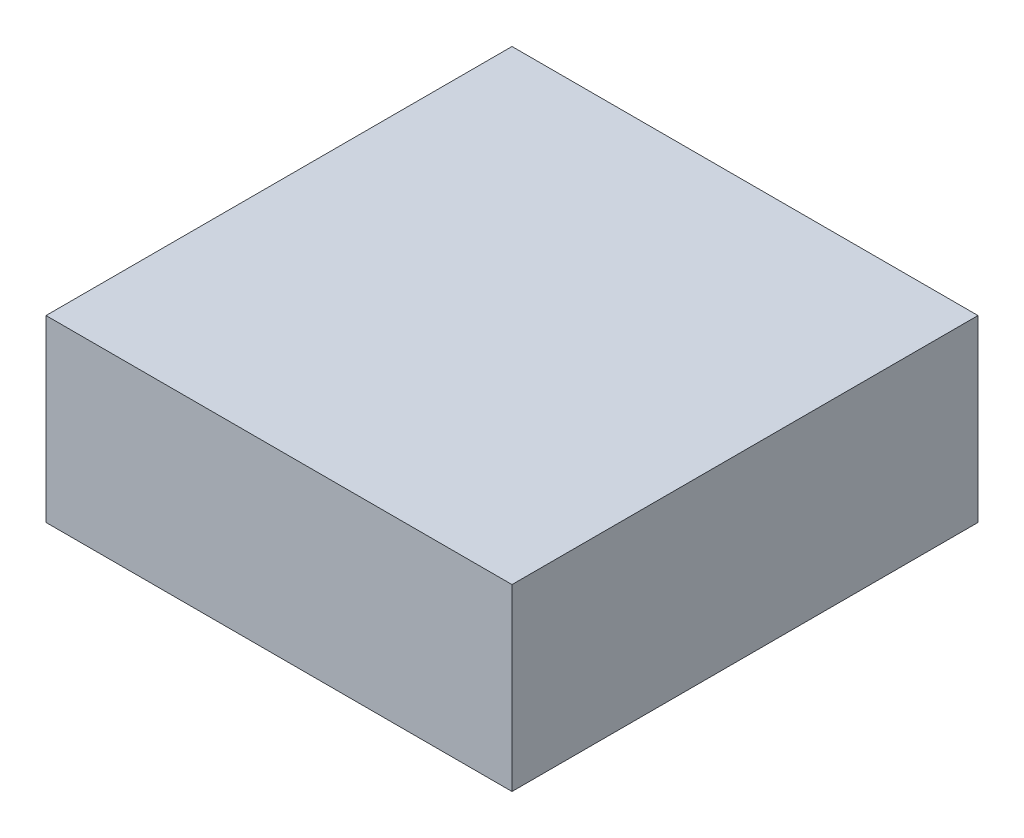
ISO-10303-21;
HEADER;
FILE_DESCRIPTION(('STEP AP214'),'2;1');
FILE_NAME('part.step','',(''),(''),'','','');
FILE_SCHEMA(('AUTOMOTIVE_DESIGN { 1 0 10303 214 1 1 1 1 }'));
ENDSEC;
DATA;
#1=APPLICATION_CONTEXT('core data for automotive mechanical design processes');
#2=APPLICATION_PROTOCOL_DEFINITION('international standard','automotive_design',2000,#1);
#3=PRODUCT_CONTEXT('',#1,'mechanical');
#4=PRODUCT('Part','Part','',(#3));
#5=PRODUCT_RELATED_PRODUCT_CATEGORY('part','',(#4));
#6=PRODUCT_DEFINITION_FORMATION('','',#4);
#7=PRODUCT_DEFINITION_CONTEXT('part definition',#1,'design');
#8=PRODUCT_DEFINITION('design','',#6,#7);
#9=PRODUCT_DEFINITION_SHAPE('','',#8);
#10=(LENGTH_UNIT() NAMED_UNIT(*) SI_UNIT(.MILLI.,.METRE.));
#11=(NAMED_UNIT(*) PLANE_ANGLE_UNIT() SI_UNIT($,.RADIAN.));
#12=(NAMED_UNIT(*) SI_UNIT($,.STERADIAN.) SOLID_ANGLE_UNIT());
#13=UNCERTAINTY_MEASURE_WITH_UNIT(LENGTH_MEASURE(1.E-05),#10,'distance_accuracy_value','');
#14=(GEOMETRIC_REPRESENTATION_CONTEXT(3) GLOBAL_UNCERTAINTY_ASSIGNED_CONTEXT((#13)) GLOBAL_UNIT_ASSIGNED_CONTEXT((#10,
#11,#12)) REPRESENTATION_CONTEXT('',''));
#15=CARTESIAN_POINT('',(0.,0.,0.));
#16=DIRECTION('',(0.,0.,1.));
#17=DIRECTION('',(1.,0.,0.));
#18=AXIS2_PLACEMENT_3D('',#15,#16,#17);
#19=CARTESIAN_POINT('',(0.,50.,0.));
#20=DIRECTION('',(1.,0.,0.));
#21=DIRECTION('',(0.,0.,-1.));
#22=AXIS2_PLACEMENT_3D('',#19,#20,#21);
#23=PLANE('',#22);
#24=DIRECTION('',(0.,0.,1.));
#25=VECTOR('',#24,1.);
#26=CARTESIAN_POINT('',(0.,0.,0.));
#27=LINE('',#26,#25);
#28=CARTESIAN_POINT('',(0.,0.,-130.));
#29=VERTEX_POINT('',#28);
#30=CARTESIAN_POINT('',(0.,0.,0.));
#31=VERTEX_POINT('',#30);
#32=EDGE_CURVE('E166',#29,#31,#27,.T.);
#33=ORIENTED_EDGE('',*,*,#32,.T.);
#34=DIRECTION('',(0.,-1.,0.));
#35=VECTOR('',#34,1.);
#36=CARTESIAN_POINT('',(0.,50.,0.));
#37=LINE('',#36,#35);
#38=CARTESIAN_POINT('',(0.,50.,0.));
#39=VERTEX_POINT('',#38);
#40=EDGE_CURVE('E11',#39,#31,#37,.T.);
#41=ORIENTED_EDGE('',*,*,#40,.F.);
#42=DIRECTION('',(0.,0.,1.));
#43=VECTOR('',#42,1.);
#44=CARTESIAN_POINT('',(0.,50.,0.));
#45=LINE('',#44,#43);
#46=CARTESIAN_POINT('',(0.,50.,-130.));
#47=VERTEX_POINT('',#46);
#48=EDGE_CURVE('E172',#47,#39,#45,.T.);
#49=ORIENTED_EDGE('',*,*,#48,.F.);
#50=DIRECTION('',(0.,-1.,0.));
#51=VECTOR('',#50,1.);
#52=CARTESIAN_POINT('',(0.,50.,-130.));
#53=LINE('',#52,#51);
#54=EDGE_CURVE('E182',#47,#29,#53,.T.);
#55=ORIENTED_EDGE('',*,*,#54,.T.);
#56=EDGE_LOOP('',(#33,#41,#49,#55));
#57=FACE_BOUND('',#56,.T.);
#58=ADVANCED_FACE('F43',(#57),#23,.F.);
#59=CARTESIAN_POINT('',(0.,50.,0.));
#60=DIRECTION('',(0.,0.,-1.));
#61=DIRECTION('',(-1.,0.,0.));
#62=AXIS2_PLACEMENT_3D('',#59,#60,#61);
#63=PLANE('',#62);
#64=DIRECTION('',(1.,0.,0.));
#65=VECTOR('',#64,1.);
#66=CARTESIAN_POINT('',(0.,0.,0.));
#67=LINE('',#66,#65);
#68=CARTESIAN_POINT('',(130.,0.,0.));
#69=VERTEX_POINT('',#68);
#70=EDGE_CURVE('E186',#31,#69,#67,.T.);
#71=ORIENTED_EDGE('',*,*,#70,.T.);
#72=DIRECTION('',(0.,-1.,0.));
#73=VECTOR('',#72,1.);
#74=CARTESIAN_POINT('',(130.,50.,0.));
#75=LINE('',#74,#73);
#76=CARTESIAN_POINT('',(130.,50.,0.));
#77=VERTEX_POINT('',#76);
#78=EDGE_CURVE('E51',#77,#69,#75,.T.);
#79=ORIENTED_EDGE('',*,*,#78,.F.);
#80=DIRECTION('',(1.,0.,0.));
#81=VECTOR('',#80,1.);
#82=CARTESIAN_POINT('',(0.,50.,0.));
#83=LINE('',#82,#81);
#84=EDGE_CURVE('E95',#39,#77,#83,.T.);
#85=ORIENTED_EDGE('',*,*,#84,.F.);
#86=ORIENTED_EDGE('',*,*,#40,.T.);
#87=EDGE_LOOP('',(#71,#79,#85,#86));
#88=FACE_BOUND('',#87,.T.);
#89=ADVANCED_FACE('F220',(#88),#63,.F.);
#90=CARTESIAN_POINT('',(130.,50.,0.));
#91=DIRECTION('',(-1.,0.,0.));
#92=DIRECTION('',(0.,0.,1.));
#93=AXIS2_PLACEMENT_3D('',#90,#91,#92);
#94=PLANE('',#93);
#95=DIRECTION('',(0.,0.,-1.));
#96=VECTOR('',#95,1.);
#97=CARTESIAN_POINT('',(130.,0.,0.));
#98=LINE('',#97,#96);
#99=CARTESIAN_POINT('',(130.,0.,-130.));
#100=VERTEX_POINT('',#99);
#101=EDGE_CURVE('E189',#69,#100,#98,.T.);
#102=ORIENTED_EDGE('',*,*,#101,.T.);
#103=DIRECTION('',(0.,-1.,0.));
#104=VECTOR('',#103,1.);
#105=CARTESIAN_POINT('',(130.,50.,-130.));
#106=LINE('',#105,#104);
#107=CARTESIAN_POINT('',(130.,50.,-130.));
#108=VERTEX_POINT('',#107);
#109=EDGE_CURVE('E196',#108,#100,#106,.T.);
#110=ORIENTED_EDGE('',*,*,#109,.F.);
#111=DIRECTION('',(0.,0.,-1.));
#112=VECTOR('',#111,1.);
#113=CARTESIAN_POINT('',(130.,50.,0.));
#114=LINE('',#113,#112);
#115=EDGE_CURVE('E177',#77,#108,#114,.T.);
#116=ORIENTED_EDGE('',*,*,#115,.F.);
#117=ORIENTED_EDGE('',*,*,#78,.T.);
#118=EDGE_LOOP('',(#102,#110,#116,#117));
#119=FACE_BOUND('',#118,.T.);
#120=ADVANCED_FACE('F203',(#119),#94,.F.);
#121=CARTESIAN_POINT('',(0.,50.,-130.));
#122=DIRECTION('',(0.,0.,1.));
#123=DIRECTION('',(1.,0.,0.));
#124=AXIS2_PLACEMENT_3D('',#121,#122,#123);
#125=PLANE('',#124);
#126=DIRECTION('',(-1.,0.,0.));
#127=VECTOR('',#126,1.);
#128=CARTESIAN_POINT('',(0.,0.,-130.));
#129=LINE('',#128,#127);
#130=EDGE_CURVE('E88',#100,#29,#129,.T.);
#131=ORIENTED_EDGE('',*,*,#130,.T.);
#132=ORIENTED_EDGE('',*,*,#54,.F.);
#133=DIRECTION('',(-1.,0.,0.));
#134=VECTOR('',#133,1.);
#135=CARTESIAN_POINT('',(0.,50.,-130.));
#136=LINE('',#135,#134);
#137=EDGE_CURVE('E67',#108,#47,#136,.T.);
#138=ORIENTED_EDGE('',*,*,#137,.F.);
#139=ORIENTED_EDGE('',*,*,#109,.T.);
#140=EDGE_LOOP('',(#131,#132,#138,#139));
#141=FACE_BOUND('',#140,.T.);
#142=ADVANCED_FACE('F211',(#141),#125,.F.);
#143=CARTESIAN_POINT('',(0.,50.,0.));
#144=DIRECTION('',(0.,-1.,0.));
#145=DIRECTION('',(0.,0.,-1.));
#146=AXIS2_PLACEMENT_3D('',#143,#144,#145);
#147=PLANE('',#146);
#148=ORIENTED_EDGE('',*,*,#48,.T.);
#149=ORIENTED_EDGE('',*,*,#84,.T.);
#150=ORIENTED_EDGE('',*,*,#115,.T.);
#151=ORIENTED_EDGE('',*,*,#137,.T.);
#152=EDGE_LOOP('',(#148,#149,#150,#151));
#153=FACE_BOUND('',#152,.T.);
#154=ADVANCED_FACE('F213',(#153),#147,.F.);
#155=CARTESIAN_POINT('',(0.,0.,0.));
#156=DIRECTION('',(0.,-1.,0.));
#157=DIRECTION('',(0.,0.,-1.));
#158=AXIS2_PLACEMENT_3D('',#155,#156,#157);
#159=PLANE('',#158);
#160=DIRECTION('',(0.,0.,-1.));
#161=VECTOR('',#160,1.);
#162=CARTESIAN_POINT('',(5.,0.,-5.));
#163=LINE('',#162,#161);
#164=CARTESIAN_POINT('',(5.,0.,-5.));
#165=VERTEX_POINT('',#164);
#166=CARTESIAN_POINT('',(5.00000000000002,0.,-125.));
#167=VERTEX_POINT('',#166);
#168=EDGE_CURVE('E58',#165,#167,#163,.T.);
#169=ORIENTED_EDGE('',*,*,#168,.F.);
#170=DIRECTION('',(-1.,0.,0.));
#171=VECTOR('',#170,1.);
#172=CARTESIAN_POINT('',(5.,0.,-5.));
#173=LINE('',#172,#171);
#174=CARTESIAN_POINT('',(125.,0.,-5.));
#175=VERTEX_POINT('',#174);
#176=EDGE_CURVE('E140',#175,#165,#173,.T.);
#177=ORIENTED_EDGE('',*,*,#176,.F.);
#178=DIRECTION('',(0.,0.,1.));
#179=VECTOR('',#178,1.);
#180=CARTESIAN_POINT('',(125.,0.,-5.));
#181=LINE('',#180,#179);
#182=CARTESIAN_POINT('',(125.,0.,-125.));
#183=VERTEX_POINT('',#182);
#184=EDGE_CURVE('E144',#183,#175,#181,.T.);
#185=ORIENTED_EDGE('',*,*,#184,.F.);
#186=DIRECTION('',(1.,0.,0.));
#187=VECTOR('',#186,1.);
#188=CARTESIAN_POINT('',(5.00000000000002,0.,-125.));
#189=LINE('',#188,#187);
#190=EDGE_CURVE('E156',#167,#183,#189,.T.);
#191=ORIENTED_EDGE('',*,*,#190,.F.);
#192=EDGE_LOOP('',(#169,#177,#185,#191));
#193=FACE_BOUND('',#192,.T.);
#194=ORIENTED_EDGE('',*,*,#32,.F.);
#195=ORIENTED_EDGE('',*,*,#130,.F.);
#196=ORIENTED_EDGE('',*,*,#101,.F.);
#197=ORIENTED_EDGE('',*,*,#70,.F.);
#198=EDGE_LOOP('',(#194,#195,#196,#197));
#199=FACE_BOUND('',#198,.T.);
#200=ADVANCED_FACE('F207',(#193,#199),#159,.T.);
#201=CARTESIAN_POINT('',(5.,45.,-5.));
#202=DIRECTION('',(-1.,0.,0.));
#203=DIRECTION('',(0.,0.,1.));
#204=AXIS2_PLACEMENT_3D('',#201,#202,#203);
#205=PLANE('',#204);
#206=ORIENTED_EDGE('',*,*,#168,.T.);
#207=DIRECTION('',(0.,-1.,0.));
#208=VECTOR('',#207,1.);
#209=CARTESIAN_POINT('',(5.00000000000002,45.,-125.));
#210=LINE('',#209,#208);
#211=CARTESIAN_POINT('',(5.00000000000002,45.,-125.));
#212=VERTEX_POINT('',#211);
#213=EDGE_CURVE('E115',#212,#167,#210,.T.);
#214=ORIENTED_EDGE('',*,*,#213,.F.);
#215=DIRECTION('',(0.,0.,-1.));
#216=VECTOR('',#215,1.);
#217=CARTESIAN_POINT('',(5.,45.,-5.));
#218=LINE('',#217,#216);
#219=CARTESIAN_POINT('',(5.,45.,-5.));
#220=VERTEX_POINT('',#219);
#221=EDGE_CURVE('E119',#220,#212,#218,.T.);
#222=ORIENTED_EDGE('',*,*,#221,.F.);
#223=DIRECTION('',(0.,-1.,0.));
#224=VECTOR('',#223,1.);
#225=CARTESIAN_POINT('',(5.,45.,-5.));
#226=LINE('',#225,#224);
#227=EDGE_CURVE('E163',#220,#165,#226,.T.);
#228=ORIENTED_EDGE('',*,*,#227,.T.);
#229=EDGE_LOOP('',(#206,#214,#222,#228));
#230=FACE_BOUND('',#229,.T.);
#231=ADVANCED_FACE('F117',(#230),#205,.F.);
#232=CARTESIAN_POINT('',(5.,45.,-5.));
#233=DIRECTION('',(0.,0.,1.));
#234=DIRECTION('',(1.,0.,0.));
#235=AXIS2_PLACEMENT_3D('',#232,#233,#234);
#236=PLANE('',#235);
#237=ORIENTED_EDGE('',*,*,#176,.T.);
#238=ORIENTED_EDGE('',*,*,#227,.F.);
#239=DIRECTION('',(-1.,0.,0.));
#240=VECTOR('',#239,1.);
#241=CARTESIAN_POINT('',(5.,45.,-5.));
#242=LINE('',#241,#240);
#243=CARTESIAN_POINT('',(125.,45.,-5.));
#244=VERTEX_POINT('',#243);
#245=EDGE_CURVE('E126',#244,#220,#242,.T.);
#246=ORIENTED_EDGE('',*,*,#245,.F.);
#247=DIRECTION('',(0.,-1.,0.));
#248=VECTOR('',#247,1.);
#249=CARTESIAN_POINT('',(125.,45.,-5.));
#250=LINE('',#249,#248);
#251=EDGE_CURVE('E167',#244,#175,#250,.T.);
#252=ORIENTED_EDGE('',*,*,#251,.T.);
#253=EDGE_LOOP('',(#237,#238,#246,#252));
#254=FACE_BOUND('',#253,.T.);
#255=ADVANCED_FACE('F264',(#254),#236,.F.);
#256=CARTESIAN_POINT('',(125.,45.,-5.));
#257=DIRECTION('',(1.,0.,0.));
#258=DIRECTION('',(0.,0.,-1.));
#259=AXIS2_PLACEMENT_3D('',#256,#257,#258);
#260=PLANE('',#259);
#261=ORIENTED_EDGE('',*,*,#184,.T.);
#262=ORIENTED_EDGE('',*,*,#251,.F.);
#263=DIRECTION('',(0.,0.,1.));
#264=VECTOR('',#263,1.);
#265=CARTESIAN_POINT('',(125.,45.,-5.));
#266=LINE('',#265,#264);
#267=CARTESIAN_POINT('',(125.,45.,-125.));
#268=VERTEX_POINT('',#267);
#269=EDGE_CURVE('E135',#268,#244,#266,.T.);
#270=ORIENTED_EDGE('',*,*,#269,.F.);
#271=DIRECTION('',(0.,-1.,0.));
#272=VECTOR('',#271,1.);
#273=CARTESIAN_POINT('',(125.,45.,-125.));
#274=LINE('',#273,#272);
#275=EDGE_CURVE('E125',#268,#183,#274,.T.);
#276=ORIENTED_EDGE('',*,*,#275,.T.);
#277=EDGE_LOOP('',(#261,#262,#270,#276));
#278=FACE_BOUND('',#277,.T.);
#279=ADVANCED_FACE('F274',(#278),#260,.F.);
#280=CARTESIAN_POINT('',(5.00000000000002,45.,-125.));
#281=DIRECTION('',(0.,0.,-1.));
#282=DIRECTION('',(-1.,0.,0.));
#283=AXIS2_PLACEMENT_3D('',#280,#281,#282);
#284=PLANE('',#283);
#285=ORIENTED_EDGE('',*,*,#190,.T.);
#286=ORIENTED_EDGE('',*,*,#275,.F.);
#287=DIRECTION('',(1.,0.,0.));
#288=VECTOR('',#287,1.);
#289=CARTESIAN_POINT('',(5.00000000000002,45.,-125.));
#290=LINE('',#289,#288);
#291=EDGE_CURVE('E129',#212,#268,#290,.T.);
#292=ORIENTED_EDGE('',*,*,#291,.F.);
#293=ORIENTED_EDGE('',*,*,#213,.T.);
#294=EDGE_LOOP('',(#285,#286,#292,#293));
#295=FACE_BOUND('',#294,.T.);
#296=ADVANCED_FACE('F130',(#295),#284,.F.);
#297=CARTESIAN_POINT('',(0.,45.,0.));
#298=DIRECTION('',(0.,-1.,0.));
#299=DIRECTION('',(0.,0.,-1.));
#300=AXIS2_PLACEMENT_3D('',#297,#298,#299);
#301=PLANE('',#300);
#302=CARTESIAN_POINT('',(121.,45.,-9.));
#303=DIRECTION('',(0.,-1.,0.));
#304=DIRECTION('',(0.,0.,-1.));
#305=AXIS2_PLACEMENT_3D('',#302,#303,#304);
#306=CIRCLE('',#305,2.5);
#307=CARTESIAN_POINT('',(121.,45.,-11.5));
#308=VERTEX_POINT('',#307);
#309=EDGE_CURVE('E428',#308,#308,#306,.T.);
#310=ORIENTED_EDGE('',*,*,#309,.F.);
#311=EDGE_LOOP('',(#310));
#312=FACE_BOUND('',#311,.T.);
#313=CARTESIAN_POINT('',(9.00000000000001,45.,-9.00000000000001));
#314=DIRECTION('',(0.,-1.,0.));
#315=DIRECTION('',(0.,0.,-1.));
#316=AXIS2_PLACEMENT_3D('',#313,#314,#315);
#317=CIRCLE('',#316,2.49999999999999);
#318=CARTESIAN_POINT('',(9.00000000000001,45.,-11.5));
#319=VERTEX_POINT('',#318);
#320=EDGE_CURVE('E435',#319,#319,#317,.T.);
#321=ORIENTED_EDGE('',*,*,#320,.F.);
#322=EDGE_LOOP('',(#321));
#323=FACE_BOUND('',#322,.T.);
#324=CARTESIAN_POINT('',(121.,45.,-121.));
#325=DIRECTION('',(0.,-1.,0.));
#326=DIRECTION('',(0.,0.,-1.));
#327=AXIS2_PLACEMENT_3D('',#324,#325,#326);
#328=CIRCLE('',#327,2.5);
#329=CARTESIAN_POINT('',(121.,45.,-123.5));
#330=VERTEX_POINT('',#329);
#331=EDGE_CURVE('E443',#330,#330,#328,.T.);
#332=ORIENTED_EDGE('',*,*,#331,.F.);
#333=EDGE_LOOP('',(#332));
#334=FACE_BOUND('',#333,.T.);
#335=CARTESIAN_POINT('',(9.00000000000002,45.,-121.));
#336=DIRECTION('',(0.,-1.,0.));
#337=DIRECTION('',(0.,0.,-1.));
#338=AXIS2_PLACEMENT_3D('',#335,#336,#337);
#339=CIRCLE('',#338,2.5);
#340=CARTESIAN_POINT('',(9.00000000000002,45.,-123.5));
#341=VERTEX_POINT('',#340);
#342=EDGE_CURVE('E147',#341,#341,#339,.T.);
#343=ORIENTED_EDGE('',*,*,#342,.F.);
#344=EDGE_LOOP('',(#343));
#345=FACE_BOUND('',#344,.T.);
#346=ORIENTED_EDGE('',*,*,#221,.T.);
#347=ORIENTED_EDGE('',*,*,#291,.T.);
#348=ORIENTED_EDGE('',*,*,#269,.T.);
#349=ORIENTED_EDGE('',*,*,#245,.T.);
#350=EDGE_LOOP('',(#346,#347,#348,#349));
#351=FACE_BOUND('',#350,.T.);
#352=ADVANCED_FACE('F137',(#312,#323,#334,#345,#351),#301,.T.);
#353=CARTESIAN_POINT('',(9.00000000000002,40.,-121.));
#354=DIRECTION('',(0.,1.,0.));
#355=DIRECTION('',(0.,0.,1.));
#356=AXIS2_PLACEMENT_3D('',#353,#354,#355);
#357=CYLINDRICAL_SURFACE('',#356,2.5);
#358=CARTESIAN_POINT('',(9.00000000000002,40.,-121.));
#359=DIRECTION('',(0.,-1.,0.));
#360=DIRECTION('',(0.,0.,-1.));
#361=AXIS2_PLACEMENT_3D('',#358,#359,#360);
#362=CIRCLE('',#361,2.5);
#363=CARTESIAN_POINT('',(9.00000000000002,40.,-123.5));
#364=VERTEX_POINT('',#363);
#365=EDGE_CURVE('E157',#364,#364,#362,.T.);
#366=ORIENTED_EDGE('',*,*,#365,.F.);
#367=EDGE_LOOP('',(#366));
#368=FACE_BOUND('',#367,.T.);
#369=ORIENTED_EDGE('',*,*,#342,.T.);
#370=EDGE_LOOP('',(#369));
#371=FACE_BOUND('',#370,.T.);
#372=ADVANCED_FACE('F304',(#368,#371),#357,.T.);
#373=CARTESIAN_POINT('',(9.00000000000002,40.,-121.));
#374=DIRECTION('',(0.,-1.,0.));
#375=DIRECTION('',(0.,0.,-1.));
#376=AXIS2_PLACEMENT_3D('',#373,#374,#375);
#377=PLANE('',#376);
#378=ORIENTED_EDGE('',*,*,#365,.T.);
#379=EDGE_LOOP('',(#378));
#380=FACE_BOUND('',#379,.T.);
#381=ADVANCED_FACE('F315',(#380),#377,.T.);
#382=CARTESIAN_POINT('',(121.,40.,-121.));
#383=DIRECTION('',(0.,1.,0.));
#384=DIRECTION('',(0.,0.,1.));
#385=AXIS2_PLACEMENT_3D('',#382,#383,#384);
#386=CYLINDRICAL_SURFACE('',#385,2.5);
#387=CARTESIAN_POINT('',(121.,40.,-121.));
#388=DIRECTION('',(0.,-1.,0.));
#389=DIRECTION('',(0.,0.,-1.));
#390=AXIS2_PLACEMENT_3D('',#387,#388,#389);
#391=CIRCLE('',#390,2.5);
#392=CARTESIAN_POINT('',(121.,40.,-123.5));
#393=VERTEX_POINT('',#392);
#394=EDGE_CURVE('E439',#393,#393,#391,.T.);
#395=ORIENTED_EDGE('',*,*,#394,.F.);
#396=EDGE_LOOP('',(#395));
#397=FACE_BOUND('',#396,.T.);
#398=ORIENTED_EDGE('',*,*,#331,.T.);
#399=EDGE_LOOP('',(#398));
#400=FACE_BOUND('',#399,.T.);
#401=ADVANCED_FACE('F326',(#397,#400),#386,.T.);
#402=CARTESIAN_POINT('',(121.,40.,-121.));
#403=DIRECTION('',(0.,-1.,0.));
#404=DIRECTION('',(0.,0.,-1.));
#405=AXIS2_PLACEMENT_3D('',#402,#403,#404);
#406=PLANE('',#405);
#407=ORIENTED_EDGE('',*,*,#394,.T.);
#408=EDGE_LOOP('',(#407));
#409=FACE_BOUND('',#408,.T.);
#410=ADVANCED_FACE('F337',(#409),#406,.T.);
#411=CARTESIAN_POINT('',(9.00000000000001,40.,-9.00000000000001));
#412=DIRECTION('',(0.,1.,0.));
#413=DIRECTION('',(0.,0.,1.));
#414=AXIS2_PLACEMENT_3D('',#411,#412,#413);
#415=CYLINDRICAL_SURFACE('',#414,2.49999999999999);
#416=CARTESIAN_POINT('',(9.00000000000001,40.,-9.00000000000001));
#417=DIRECTION('',(0.,-1.,0.));
#418=DIRECTION('',(0.,0.,-1.));
#419=AXIS2_PLACEMENT_3D('',#416,#417,#418);
#420=CIRCLE('',#419,2.49999999999999);
#421=CARTESIAN_POINT('',(9.00000000000001,40.,-11.5));
#422=VERTEX_POINT('',#421);
#423=EDGE_CURVE('E432',#422,#422,#420,.T.);
#424=ORIENTED_EDGE('',*,*,#423,.F.);
#425=EDGE_LOOP('',(#424));
#426=FACE_BOUND('',#425,.T.);
#427=ORIENTED_EDGE('',*,*,#320,.T.);
#428=EDGE_LOOP('',(#427));
#429=FACE_BOUND('',#428,.T.);
#430=ADVANCED_FACE('F348',(#426,#429),#415,.T.);
#431=CARTESIAN_POINT('',(9.00000000000001,40.,-9.00000000000001));
#432=DIRECTION('',(0.,-1.,0.));
#433=DIRECTION('',(0.,0.,-1.));
#434=AXIS2_PLACEMENT_3D('',#431,#432,#433);
#435=PLANE('',#434);
#436=ORIENTED_EDGE('',*,*,#423,.T.);
#437=EDGE_LOOP('',(#436));
#438=FACE_BOUND('',#437,.T.);
#439=ADVANCED_FACE('F359',(#438),#435,.T.);
#440=CARTESIAN_POINT('',(121.,40.,-9.));
#441=DIRECTION('',(0.,1.,0.));
#442=DIRECTION('',(0.,0.,1.));
#443=AXIS2_PLACEMENT_3D('',#440,#441,#442);
#444=CYLINDRICAL_SURFACE('',#443,2.5);
#445=CARTESIAN_POINT('',(121.,40.,-9.));
#446=DIRECTION('',(0.,-1.,0.));
#447=DIRECTION('',(0.,0.,-1.));
#448=AXIS2_PLACEMENT_3D('',#445,#446,#447);
#449=CIRCLE('',#448,2.5);
#450=CARTESIAN_POINT('',(121.,40.,-11.5));
#451=VERTEX_POINT('',#450);
#452=EDGE_CURVE('E426',#451,#451,#449,.T.);
#453=ORIENTED_EDGE('',*,*,#452,.F.);
#454=EDGE_LOOP('',(#453));
#455=FACE_BOUND('',#454,.T.);
#456=ORIENTED_EDGE('',*,*,#309,.T.);
#457=EDGE_LOOP('',(#456));
#458=FACE_BOUND('',#457,.T.);
#459=ADVANCED_FACE('F370',(#455,#458),#444,.T.);
#460=CARTESIAN_POINT('',(121.,40.,-9.));
#461=DIRECTION('',(0.,-1.,0.));
#462=DIRECTION('',(0.,0.,-1.));
#463=AXIS2_PLACEMENT_3D('',#460,#461,#462);
#464=PLANE('',#463);
#465=ORIENTED_EDGE('',*,*,#452,.T.);
#466=EDGE_LOOP('',(#465));
#467=FACE_BOUND('',#466,.T.);
#468=ADVANCED_FACE('F381',(#467),#464,.T.);
#469=CLOSED_SHELL('',(#58,#89,#120,#142,#154,#200,#231,#255,#279,#296,#352,#372,#381,#401,#410,
#430,#439,#459,#468));
#470=MANIFOLD_SOLID_BREP('B2',#469);
#471=ADVANCED_BREP_SHAPE_REPRESENTATION('',(#18,#470),#14);
#472=SHAPE_DEFINITION_REPRESENTATION(#9,#471);
ENDSEC;
END-ISO-10303-21;
